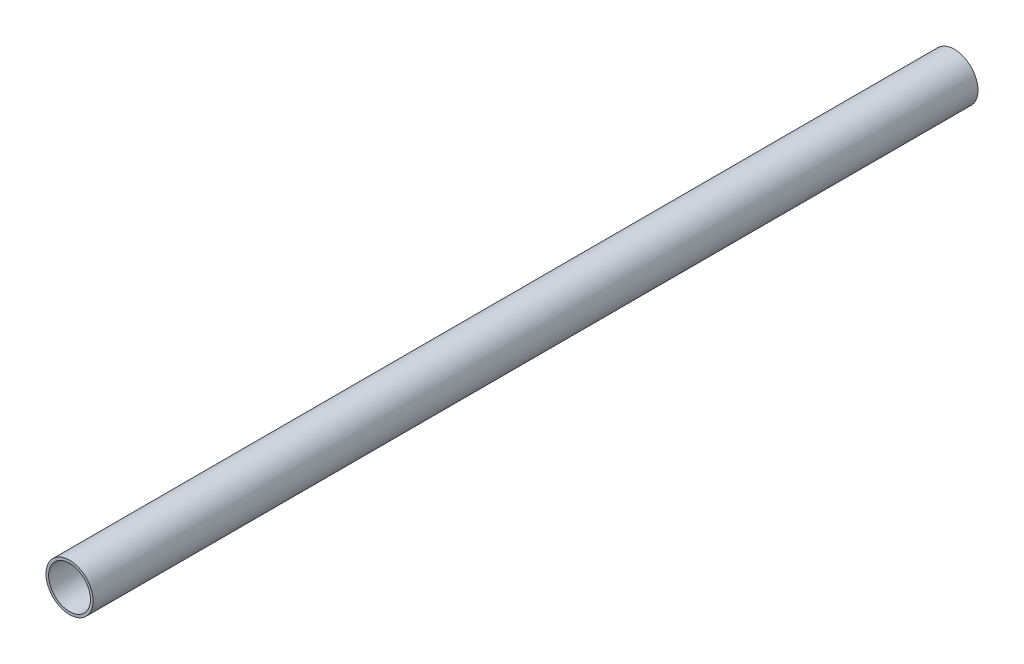
ISO-10303-21;
HEADER;
FILE_DESCRIPTION(('STEP AP214'),'2;1');
FILE_NAME('part.step','',(''),(''),'','','');
FILE_SCHEMA(('AUTOMOTIVE_DESIGN { 1 0 10303 214 1 1 1 1 }'));
ENDSEC;
DATA;
#1=APPLICATION_CONTEXT('core data for automotive mechanical design processes');
#2=APPLICATION_PROTOCOL_DEFINITION('international standard','automotive_design',2000,#1);
#3=PRODUCT_CONTEXT('',#1,'mechanical');
#4=PRODUCT('Part','Part','',(#3));
#5=PRODUCT_RELATED_PRODUCT_CATEGORY('part','',(#4));
#6=PRODUCT_DEFINITION_FORMATION('','',#4);
#7=PRODUCT_DEFINITION_CONTEXT('part definition',#1,'design');
#8=PRODUCT_DEFINITION('design','',#6,#7);
#9=PRODUCT_DEFINITION_SHAPE('','',#8);
#10=(LENGTH_UNIT() NAMED_UNIT(*) SI_UNIT(.MILLI.,.METRE.));
#11=(NAMED_UNIT(*) PLANE_ANGLE_UNIT() SI_UNIT($,.RADIAN.));
#12=(NAMED_UNIT(*) SI_UNIT($,.STERADIAN.) SOLID_ANGLE_UNIT());
#13=UNCERTAINTY_MEASURE_WITH_UNIT(LENGTH_MEASURE(1.E-05),#10,'distance_accuracy_value','');
#14=(GEOMETRIC_REPRESENTATION_CONTEXT(3) GLOBAL_UNCERTAINTY_ASSIGNED_CONTEXT((#13)) GLOBAL_UNIT_ASSIGNED_CONTEXT((#10,
#11,#12)) REPRESENTATION_CONTEXT('',''));
#15=CARTESIAN_POINT('',(0.,0.,0.));
#16=DIRECTION('',(0.,0.,1.));
#17=DIRECTION('',(1.,0.,0.));
#18=AXIS2_PLACEMENT_3D('',#15,#16,#17);
#19=CARTESIAN_POINT('',(0.,0.,622.3));
#20=DIRECTION('',(0.,0.,1.));
#21=DIRECTION('',(1.,0.,0.));
#22=AXIS2_PLACEMENT_3D('',#19,#20,#21);
#23=PLANE('',#22);
#24=CARTESIAN_POINT('',(0.,0.,622.3));
#25=DIRECTION('',(0.,0.,1.));
#26=DIRECTION('',(1.,0.,0.));
#27=AXIS2_PLACEMENT_3D('',#24,#25,#26);
#28=CIRCLE('',#27,16.59255);
#29=CARTESIAN_POINT('',(16.59255,0.,622.3));
#30=VERTEX_POINT('',#29);
#31=EDGE_CURVE('E10',#30,#30,#28,.T.);
#32=ORIENTED_EDGE('',*,*,#31,.T.);
#33=EDGE_LOOP('',(#32));
#34=FACE_BOUND('',#33,.T.);
#35=CARTESIAN_POINT('',(0.,0.,622.3));
#36=DIRECTION('',(0.,0.,1.));
#37=DIRECTION('',(1.,0.,0.));
#38=AXIS2_PLACEMENT_3D('',#35,#36,#37);
#39=CIRCLE('',#38,14.72565);
#40=CARTESIAN_POINT('',(14.72565,0.,622.3));
#41=VERTEX_POINT('',#40);
#42=EDGE_CURVE('E41',#41,#41,#39,.T.);
#43=ORIENTED_EDGE('',*,*,#42,.F.);
#44=EDGE_LOOP('',(#43));
#45=FACE_BOUND('',#44,.T.);
#46=ADVANCED_FACE('F30',(#34,#45),#23,.T.);
#47=CARTESIAN_POINT('',(0.,0.,0.));
#48=DIRECTION('',(0.,0.,1.));
#49=DIRECTION('',(1.,0.,0.));
#50=AXIS2_PLACEMENT_3D('',#47,#48,#49);
#51=PLANE('',#50);
#52=CARTESIAN_POINT('',(0.,0.,0.));
#53=DIRECTION('',(0.,0.,1.));
#54=DIRECTION('',(1.,0.,0.));
#55=AXIS2_PLACEMENT_3D('',#52,#53,#54);
#56=CIRCLE('',#55,16.59255);
#57=CARTESIAN_POINT('',(16.59255,0.,0.));
#58=VERTEX_POINT('',#57);
#59=EDGE_CURVE('E34',#58,#58,#56,.T.);
#60=ORIENTED_EDGE('',*,*,#59,.F.);
#61=EDGE_LOOP('',(#60));
#62=FACE_BOUND('',#61,.T.);
#63=CARTESIAN_POINT('',(0.,0.,0.));
#64=DIRECTION('',(0.,0.,1.));
#65=DIRECTION('',(1.,0.,0.));
#66=AXIS2_PLACEMENT_3D('',#63,#64,#65);
#67=CIRCLE('',#66,14.72565);
#68=CARTESIAN_POINT('',(14.72565,0.,0.));
#69=VERTEX_POINT('',#68);
#70=EDGE_CURVE('E43',#69,#69,#67,.T.);
#71=ORIENTED_EDGE('',*,*,#70,.T.);
#72=EDGE_LOOP('',(#71));
#73=FACE_BOUND('',#72,.T.);
#74=ADVANCED_FACE('F53',(#62,#73),#51,.F.);
#75=CARTESIAN_POINT('',(0.,0.,622.3));
#76=DIRECTION('',(0.,0.,-1.));
#77=DIRECTION('',(-1.,0.,0.));
#78=AXIS2_PLACEMENT_3D('',#75,#76,#77);
#79=CYLINDRICAL_SURFACE('',#78,16.59255);
#80=ORIENTED_EDGE('',*,*,#31,.F.);
#81=EDGE_LOOP('',(#80));
#82=FACE_BOUND('',#81,.T.);
#83=ORIENTED_EDGE('',*,*,#59,.T.);
#84=EDGE_LOOP('',(#83));
#85=FACE_BOUND('',#84,.T.);
#86=ADVANCED_FACE('F32',(#82,#85),#79,.T.);
#87=CARTESIAN_POINT('',(0.,0.,622.3));
#88=DIRECTION('',(0.,0.,-1.));
#89=DIRECTION('',(-1.,0.,0.));
#90=AXIS2_PLACEMENT_3D('',#87,#88,#89);
#91=CYLINDRICAL_SURFACE('',#90,14.72565);
#92=ORIENTED_EDGE('',*,*,#42,.T.);
#93=EDGE_LOOP('',(#92));
#94=FACE_BOUND('',#93,.T.);
#95=ORIENTED_EDGE('',*,*,#70,.F.);
#96=EDGE_LOOP('',(#95));
#97=FACE_BOUND('',#96,.T.);
#98=ADVANCED_FACE('F49',(#94,#97),#91,.F.);
#99=CLOSED_SHELL('',(#46,#74,#86,#98));
#100=MANIFOLD_SOLID_BREP('B2',#99);
#101=ADVANCED_BREP_SHAPE_REPRESENTATION('',(#18,#100),#14);
#102=SHAPE_DEFINITION_REPRESENTATION(#9,#101);
ENDSEC;
END-ISO-10303-21;
